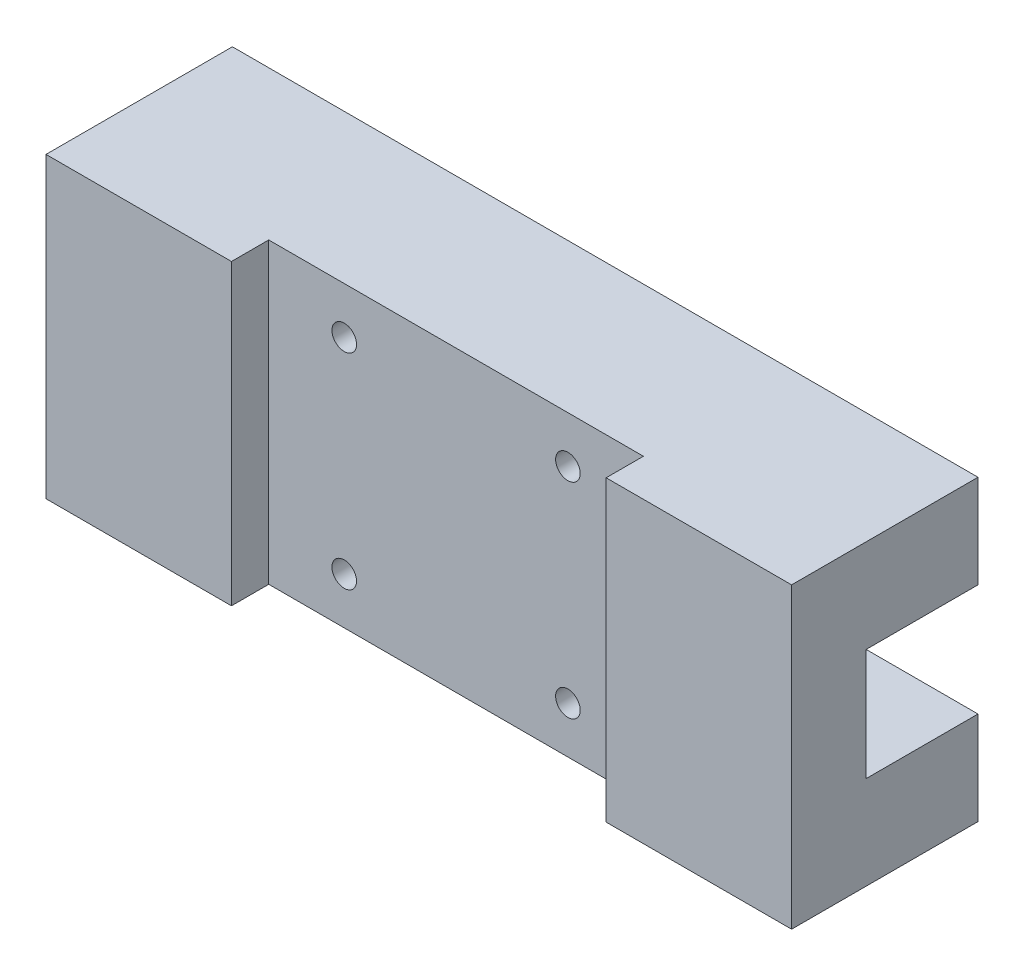
ISO-10303-21;
HEADER;
FILE_DESCRIPTION(('STEP AP214'),'2;1');
FILE_NAME('part.step','',(''),(''),'','','');
FILE_SCHEMA(('AUTOMOTIVE_DESIGN { 1 0 10303 214 1 1 1 1 }'));
ENDSEC;
DATA;
#1=APPLICATION_CONTEXT('core data for automotive mechanical design processes');
#2=APPLICATION_PROTOCOL_DEFINITION('international standard','automotive_design',2000,#1);
#3=PRODUCT_CONTEXT('',#1,'mechanical');
#4=PRODUCT('Part','Part','',(#3));
#5=PRODUCT_RELATED_PRODUCT_CATEGORY('part','',(#4));
#6=PRODUCT_DEFINITION_FORMATION('','',#4);
#7=PRODUCT_DEFINITION_CONTEXT('part definition',#1,'design');
#8=PRODUCT_DEFINITION('design','',#6,#7);
#9=PRODUCT_DEFINITION_SHAPE('','',#8);
#10=(LENGTH_UNIT() NAMED_UNIT(*) SI_UNIT(.MILLI.,.METRE.));
#11=(NAMED_UNIT(*) PLANE_ANGLE_UNIT() SI_UNIT($,.RADIAN.));
#12=(NAMED_UNIT(*) SI_UNIT($,.STERADIAN.) SOLID_ANGLE_UNIT());
#13=UNCERTAINTY_MEASURE_WITH_UNIT(LENGTH_MEASURE(1.E-05),#10,'distance_accuracy_value','');
#14=(GEOMETRIC_REPRESENTATION_CONTEXT(3) GLOBAL_UNCERTAINTY_ASSIGNED_CONTEXT((#13)) GLOBAL_UNIT_ASSIGNED_CONTEXT((#10,
#11,#12)) REPRESENTATION_CONTEXT('',''));
#15=CARTESIAN_POINT('',(0.,0.,0.));
#16=DIRECTION('',(0.,0.,1.));
#17=DIRECTION('',(1.,0.,0.));
#18=AXIS2_PLACEMENT_3D('',#15,#16,#17);
#19=CARTESIAN_POINT('',(0.,0.,50.));
#20=DIRECTION('',(0.,1.,0.));
#21=DIRECTION('',(0.,0.,1.));
#22=AXIS2_PLACEMENT_3D('',#19,#20,#21);
#23=PLANE('',#22);
#24=CARTESIAN_POINT('',(175.,0.,15.));
#25=DIRECTION('',(0.,-1.,0.));
#26=DIRECTION('',(0.,0.,-1.));
#27=AXIS2_PLACEMENT_3D('',#24,#25,#26);
#28=CIRCLE('',#27,5.);
#29=CARTESIAN_POINT('',(175.,0.,10.));
#30=VERTEX_POINT('',#29);
#31=EDGE_CURVE('E648',#30,#30,#28,.T.);
#32=ORIENTED_EDGE('',*,*,#31,.F.);
#33=EDGE_LOOP('',(#32));
#34=FACE_BOUND('',#33,.T.);
#35=DIRECTION('',(-1.,0.,0.));
#36=VECTOR('',#35,1.);
#37=CARTESIAN_POINT('',(49.75,0.,40.));
#38=LINE('',#37,#36);
#39=CARTESIAN_POINT('',(150.25,0.,40.));
#40=VERTEX_POINT('',#39);
#41=CARTESIAN_POINT('',(49.75,0.,40.));
#42=VERTEX_POINT('',#41);
#43=EDGE_CURVE('E167',#40,#42,#38,.T.);
#44=ORIENTED_EDGE('',*,*,#43,.T.);
#45=DIRECTION('',(0.,0.,1.));
#46=VECTOR('',#45,1.);
#47=CARTESIAN_POINT('',(49.75,0.,50.));
#48=LINE('',#47,#46);
#49=CARTESIAN_POINT('',(49.75,0.,50.));
#50=VERTEX_POINT('',#49);
#51=EDGE_CURVE('E162',#42,#50,#48,.T.);
#52=ORIENTED_EDGE('',*,*,#51,.T.);
#53=DIRECTION('',(1.,0.,0.));
#54=VECTOR('',#53,1.);
#55=CARTESIAN_POINT('',(0.,0.,50.));
#56=LINE('',#55,#54);
#57=CARTESIAN_POINT('',(0.,0.,50.));
#58=VERTEX_POINT('',#57);
#59=EDGE_CURVE('E191',#58,#50,#56,.T.);
#60=ORIENTED_EDGE('',*,*,#59,.F.);
#61=DIRECTION('',(0.,0.,-1.));
#62=VECTOR('',#61,1.);
#63=CARTESIAN_POINT('',(0.,0.,50.));
#64=LINE('',#63,#62);
#65=CARTESIAN_POINT('',(0.,0.,0.));
#66=VERTEX_POINT('',#65);
#67=EDGE_CURVE('E11',#58,#66,#64,.T.);
#68=ORIENTED_EDGE('',*,*,#67,.T.);
#69=DIRECTION('',(1.,0.,0.));
#70=VECTOR('',#69,1.);
#71=CARTESIAN_POINT('',(0.,0.,0.));
#72=LINE('',#71,#70);
#73=CARTESIAN_POINT('',(200.,0.,0.));
#74=VERTEX_POINT('',#73);
#75=EDGE_CURVE('E202',#66,#74,#72,.T.);
#76=ORIENTED_EDGE('',*,*,#75,.T.);
#77=DIRECTION('',(0.,0.,-1.));
#78=VECTOR('',#77,1.);
#79=CARTESIAN_POINT('',(200.,0.,50.));
#80=LINE('',#79,#78);
#81=CARTESIAN_POINT('',(200.,0.,50.));
#82=VERTEX_POINT('',#81);
#83=EDGE_CURVE('E42',#82,#74,#80,.T.);
#84=ORIENTED_EDGE('',*,*,#83,.F.);
#85=CARTESIAN_POINT('',(150.25,0.,50.));
#86=VERTEX_POINT('',#85);
#87=EDGE_CURVE('E189',#86,#82,#56,.T.);
#88=ORIENTED_EDGE('',*,*,#87,.F.);
#89=DIRECTION('',(0.,0.,-1.));
#90=VECTOR('',#89,1.);
#91=CARTESIAN_POINT('',(150.25,0.,50.));
#92=LINE('',#91,#90);
#93=EDGE_CURVE('E57',#86,#40,#92,.T.);
#94=ORIENTED_EDGE('',*,*,#93,.T.);
#95=EDGE_LOOP('',(#44,#52,#60,#68,#76,#84,#88,#94));
#96=FACE_BOUND('',#95,.T.);
#97=CARTESIAN_POINT('',(25.,0.,15.0000000000001));
#98=DIRECTION('',(0.,-1.,0.));
#99=DIRECTION('',(0.,0.,-1.));
#100=AXIS2_PLACEMENT_3D('',#97,#98,#99);
#101=CIRCLE('',#100,5.);
#102=CARTESIAN_POINT('',(25.,0.,10.0000000000001));
#103=VERTEX_POINT('',#102);
#104=EDGE_CURVE('E652',#103,#103,#101,.T.);
#105=ORIENTED_EDGE('',*,*,#104,.F.);
#106=EDGE_LOOP('',(#105));
#107=FACE_BOUND('',#106,.T.);
#108=ADVANCED_FACE('F34',(#34,#96,#107),#23,.F.);
#109=CARTESIAN_POINT('',(0.,0.,0.));
#110=DIRECTION('',(0.,0.,-1.));
#111=DIRECTION('',(-1.,0.,0.));
#112=AXIS2_PLACEMENT_3D('',#109,#110,#111);
#113=PLANE('',#112);
#114=CARTESIAN_POINT('',(70.,12.5,0.));
#115=DIRECTION('',(0.,0.,-1.));
#116=DIRECTION('',(-1.,0.,0.));
#117=AXIS2_PLACEMENT_3D('',#114,#115,#116);
#118=CIRCLE('',#117,6.525);
#119=CARTESIAN_POINT('',(63.475,12.5,0.));
#120=VERTEX_POINT('',#119);
#121=EDGE_CURVE('E618',#120,#120,#118,.T.);
#122=ORIENTED_EDGE('',*,*,#121,.F.);
#123=EDGE_LOOP('',(#122));
#124=FACE_BOUND('',#123,.T.);
#125=CARTESIAN_POINT('',(130.,12.5,0.));
#126=DIRECTION('',(0.,0.,-1.));
#127=DIRECTION('',(-1.,0.,0.));
#128=AXIS2_PLACEMENT_3D('',#125,#126,#127);
#129=CIRCLE('',#128,6.525);
#130=CARTESIAN_POINT('',(123.475,12.5,0.));
#131=VERTEX_POINT('',#130);
#132=EDGE_CURVE('E633',#131,#131,#129,.T.);
#133=ORIENTED_EDGE('',*,*,#132,.F.);
#134=EDGE_LOOP('',(#133));
#135=FACE_BOUND('',#134,.T.);
#136=DIRECTION('',(1.,0.,0.));
#137=VECTOR('',#136,1.);
#138=CARTESIAN_POINT('',(0.,25.,0.));
#139=LINE('',#138,#137);
#140=CARTESIAN_POINT('',(0.,25.,0.));
#141=VERTEX_POINT('',#140);
#142=CARTESIAN_POINT('',(200.,25.,0.));
#143=VERTEX_POINT('',#142);
#144=EDGE_CURVE('E156',#141,#143,#139,.T.);
#145=ORIENTED_EDGE('',*,*,#144,.T.);
#146=DIRECTION('',(0.,1.,0.));
#147=VECTOR('',#146,1.);
#148=CARTESIAN_POINT('',(200.,0.,0.));
#149=LINE('',#148,#147);
#150=EDGE_CURVE('E205',#74,#143,#149,.T.);
#151=ORIENTED_EDGE('',*,*,#150,.F.);
#152=ORIENTED_EDGE('',*,*,#75,.F.);
#153=DIRECTION('',(0.,-1.,0.));
#154=VECTOR('',#153,1.);
#155=CARTESIAN_POINT('',(0.,0.,0.));
#156=LINE('',#155,#154);
#157=EDGE_CURVE('E179',#141,#66,#156,.T.);
#158=ORIENTED_EDGE('',*,*,#157,.F.);
#159=EDGE_LOOP('',(#145,#151,#152,#158));
#160=FACE_BOUND('',#159,.T.);
#161=ADVANCED_FACE('F224',(#124,#135,#160),#113,.T.);
#162=CARTESIAN_POINT('',(0.,0.,50.));
#163=DIRECTION('',(0.,0.,-1.));
#164=DIRECTION('',(-1.,0.,0.));
#165=AXIS2_PLACEMENT_3D('',#162,#163,#164);
#166=PLANE('',#165);
#167=ORIENTED_EDGE('',*,*,#59,.T.);
#168=DIRECTION('',(0.,1.,0.));
#169=VECTOR('',#168,1.);
#170=CARTESIAN_POINT('',(49.75,0.,50.));
#171=LINE('',#170,#169);
#172=CARTESIAN_POINT('',(49.75,80.,50.));
#173=VERTEX_POINT('',#172);
#174=EDGE_CURVE('E170',#50,#173,#171,.T.);
#175=ORIENTED_EDGE('',*,*,#174,.T.);
#176=DIRECTION('',(-1.,0.,0.));
#177=VECTOR('',#176,1.);
#178=CARTESIAN_POINT('',(0.,80.,50.));
#179=LINE('',#178,#177);
#180=CARTESIAN_POINT('',(0.,80.,50.));
#181=VERTEX_POINT('',#180);
#182=EDGE_CURVE('E196',#173,#181,#179,.T.);
#183=ORIENTED_EDGE('',*,*,#182,.T.);
#184=DIRECTION('',(0.,-1.,0.));
#185=VECTOR('',#184,1.);
#186=CARTESIAN_POINT('',(0.,0.,50.));
#187=LINE('',#186,#185);
#188=EDGE_CURVE('E186',#181,#58,#187,.T.);
#189=ORIENTED_EDGE('',*,*,#188,.T.);
#190=EDGE_LOOP('',(#167,#175,#183,#189));
#191=FACE_BOUND('',#190,.T.);
#192=ADVANCED_FACE('F233',(#191),#166,.F.);
#193=CARTESIAN_POINT('',(0.,0.,50.));
#194=DIRECTION('',(1.,0.,0.));
#195=DIRECTION('',(0.,0.,-1.));
#196=AXIS2_PLACEMENT_3D('',#193,#194,#195);
#197=PLANE('',#196);
#198=DIRECTION('',(0.,-1.,0.));
#199=VECTOR('',#198,1.);
#200=CARTESIAN_POINT('',(0.,55.,30.));
#201=LINE('',#200,#199);
#202=CARTESIAN_POINT('',(0.,55.,30.));
#203=VERTEX_POINT('',#202);
#204=CARTESIAN_POINT('',(0.,25.,30.));
#205=VERTEX_POINT('',#204);
#206=EDGE_CURVE('E133',#203,#205,#201,.T.);
#207=ORIENTED_EDGE('',*,*,#206,.T.);
#208=DIRECTION('',(0.,0.,-1.));
#209=VECTOR('',#208,1.);
#210=CARTESIAN_POINT('',(0.,25.,30.));
#211=LINE('',#210,#209);
#212=EDGE_CURVE('E138',#205,#141,#211,.T.);
#213=ORIENTED_EDGE('',*,*,#212,.T.);
#214=ORIENTED_EDGE('',*,*,#157,.T.);
#215=ORIENTED_EDGE('',*,*,#67,.F.);
#216=ORIENTED_EDGE('',*,*,#188,.F.);
#217=DIRECTION('',(0.,0.,-1.));
#218=VECTOR('',#217,1.);
#219=CARTESIAN_POINT('',(0.,80.,50.));
#220=LINE('',#219,#218);
#221=CARTESIAN_POINT('',(0.,80.,0.));
#222=VERTEX_POINT('',#221);
#223=EDGE_CURVE('E200',#181,#222,#220,.T.);
#224=ORIENTED_EDGE('',*,*,#223,.T.);
#225=CARTESIAN_POINT('',(0.,55.,0.));
#226=VERTEX_POINT('',#225);
#227=EDGE_CURVE('E143',#222,#226,#156,.T.);
#228=ORIENTED_EDGE('',*,*,#227,.T.);
#229=DIRECTION('',(0.,0.,1.));
#230=VECTOR('',#229,1.);
#231=CARTESIAN_POINT('',(0.,55.,30.));
#232=LINE('',#231,#230);
#233=EDGE_CURVE('E49',#226,#203,#232,.T.);
#234=ORIENTED_EDGE('',*,*,#233,.T.);
#235=EDGE_LOOP('',(#207,#213,#214,#215,#216,#224,#228,#234));
#236=FACE_BOUND('',#235,.T.);
#237=ADVANCED_FACE('F36',(#236),#197,.F.);
#238=CARTESIAN_POINT('',(200.,0.,50.));
#239=DIRECTION('',(-1.,0.,0.));
#240=DIRECTION('',(0.,0.,1.));
#241=AXIS2_PLACEMENT_3D('',#238,#239,#240);
#242=PLANE('',#241);
#243=ORIENTED_EDGE('',*,*,#150,.T.);
#244=DIRECTION('',(0.,0.,-1.));
#245=VECTOR('',#244,1.);
#246=CARTESIAN_POINT('',(200.,25.,30.));
#247=LINE('',#246,#245);
#248=CARTESIAN_POINT('',(200.,25.,30.));
#249=VERTEX_POINT('',#248);
#250=EDGE_CURVE('E144',#249,#143,#247,.T.);
#251=ORIENTED_EDGE('',*,*,#250,.F.);
#252=DIRECTION('',(0.,-1.,0.));
#253=VECTOR('',#252,1.);
#254=CARTESIAN_POINT('',(200.,55.,30.));
#255=LINE('',#254,#253);
#256=CARTESIAN_POINT('',(200.,55.,30.));
#257=VERTEX_POINT('',#256);
#258=EDGE_CURVE('E146',#257,#249,#255,.T.);
#259=ORIENTED_EDGE('',*,*,#258,.F.);
#260=DIRECTION('',(0.,0.,1.));
#261=VECTOR('',#260,1.);
#262=CARTESIAN_POINT('',(200.,55.,30.));
#263=LINE('',#262,#261);
#264=CARTESIAN_POINT('',(200.,55.,0.));
#265=VERTEX_POINT('',#264);
#266=EDGE_CURVE('E125',#265,#257,#263,.T.);
#267=ORIENTED_EDGE('',*,*,#266,.F.);
#268=CARTESIAN_POINT('',(200.,80.,0.));
#269=VERTEX_POINT('',#268);
#270=EDGE_CURVE('E204',#265,#269,#149,.T.);
#271=ORIENTED_EDGE('',*,*,#270,.T.);
#272=DIRECTION('',(0.,0.,-1.));
#273=VECTOR('',#272,1.);
#274=CARTESIAN_POINT('',(200.,80.,50.));
#275=LINE('',#274,#273);
#276=CARTESIAN_POINT('',(200.,80.,50.));
#277=VERTEX_POINT('',#276);
#278=EDGE_CURVE('E210',#277,#269,#275,.T.);
#279=ORIENTED_EDGE('',*,*,#278,.F.);
#280=DIRECTION('',(0.,1.,0.));
#281=VECTOR('',#280,1.);
#282=CARTESIAN_POINT('',(200.,0.,50.));
#283=LINE('',#282,#281);
#284=EDGE_CURVE('E194',#82,#277,#283,.T.);
#285=ORIENTED_EDGE('',*,*,#284,.F.);
#286=ORIENTED_EDGE('',*,*,#83,.T.);
#287=EDGE_LOOP('',(#243,#251,#259,#267,#271,#279,#285,#286));
#288=FACE_BOUND('',#287,.T.);
#289=ADVANCED_FACE('F217',(#288),#242,.F.);
#290=CARTESIAN_POINT('',(0.,80.,50.));
#291=DIRECTION('',(0.,-1.,0.));
#292=DIRECTION('',(0.,0.,-1.));
#293=AXIS2_PLACEMENT_3D('',#290,#291,#292);
#294=PLANE('',#293);
#295=ORIENTED_EDGE('',*,*,#182,.F.);
#296=DIRECTION('',(0.,0.,1.));
#297=VECTOR('',#296,1.);
#298=CARTESIAN_POINT('',(49.75,80.,50.));
#299=LINE('',#298,#297);
#300=CARTESIAN_POINT('',(49.75,80.,40.));
#301=VERTEX_POINT('',#300);
#302=EDGE_CURVE('E159',#301,#173,#299,.T.);
#303=ORIENTED_EDGE('',*,*,#302,.F.);
#304=DIRECTION('',(-1.,0.,0.));
#305=VECTOR('',#304,1.);
#306=CARTESIAN_POINT('',(49.75,80.,40.));
#307=LINE('',#306,#305);
#308=CARTESIAN_POINT('',(150.25,80.,40.));
#309=VERTEX_POINT('',#308);
#310=EDGE_CURVE('E165',#309,#301,#307,.T.);
#311=ORIENTED_EDGE('',*,*,#310,.F.);
#312=DIRECTION('',(0.,0.,-1.));
#313=VECTOR('',#312,1.);
#314=CARTESIAN_POINT('',(150.25,80.,50.));
#315=LINE('',#314,#313);
#316=CARTESIAN_POINT('',(150.25,80.,50.));
#317=VERTEX_POINT('',#316);
#318=EDGE_CURVE('E172',#317,#309,#315,.T.);
#319=ORIENTED_EDGE('',*,*,#318,.F.);
#320=EDGE_CURVE('E197',#277,#317,#179,.T.);
#321=ORIENTED_EDGE('',*,*,#320,.F.);
#322=ORIENTED_EDGE('',*,*,#278,.T.);
#323=DIRECTION('',(-1.,0.,0.));
#324=VECTOR('',#323,1.);
#325=CARTESIAN_POINT('',(0.,80.,0.));
#326=LINE('',#325,#324);
#327=EDGE_CURVE('E190',#269,#222,#326,.T.);
#328=ORIENTED_EDGE('',*,*,#327,.T.);
#329=ORIENTED_EDGE('',*,*,#223,.F.);
#330=EDGE_LOOP('',(#295,#303,#311,#319,#321,#322,#328,#329));
#331=FACE_BOUND('',#330,.T.);
#332=ADVANCED_FACE('F238',(#331),#294,.F.);
#333=ORIENTED_EDGE('',*,*,#320,.T.);
#334=DIRECTION('',(0.,1.,0.));
#335=VECTOR('',#334,1.);
#336=CARTESIAN_POINT('',(150.25,0.,50.));
#337=LINE('',#336,#335);
#338=EDGE_CURVE('E182',#86,#317,#337,.T.);
#339=ORIENTED_EDGE('',*,*,#338,.F.);
#340=ORIENTED_EDGE('',*,*,#87,.T.);
#341=ORIENTED_EDGE('',*,*,#284,.T.);
#342=EDGE_LOOP('',(#333,#339,#340,#341));
#343=FACE_BOUND('',#342,.T.);
#344=ADVANCED_FACE('F247',(#343),#166,.F.);
#345=CARTESIAN_POINT('',(130.,67.5,0.));
#346=DIRECTION('',(0.,0.,-1.));
#347=DIRECTION('',(-1.,0.,0.));
#348=AXIS2_PLACEMENT_3D('',#345,#346,#347);
#349=CIRCLE('',#348,6.525);
#350=CARTESIAN_POINT('',(123.475,67.5,0.));
#351=VERTEX_POINT('',#350);
#352=EDGE_CURVE('E590',#351,#351,#349,.T.);
#353=ORIENTED_EDGE('',*,*,#352,.F.);
#354=EDGE_LOOP('',(#353));
#355=FACE_BOUND('',#354,.T.);
#356=CARTESIAN_POINT('',(70.,67.5,0.));
#357=DIRECTION('',(0.,0.,-1.));
#358=DIRECTION('',(-1.,0.,0.));
#359=AXIS2_PLACEMENT_3D('',#356,#357,#358);
#360=CIRCLE('',#359,6.525);
#361=CARTESIAN_POINT('',(63.475,67.5,0.));
#362=VERTEX_POINT('',#361);
#363=EDGE_CURVE('E603',#362,#362,#360,.T.);
#364=ORIENTED_EDGE('',*,*,#363,.F.);
#365=EDGE_LOOP('',(#364));
#366=FACE_BOUND('',#365,.T.);
#367=DIRECTION('',(1.,0.,0.));
#368=VECTOR('',#367,1.);
#369=CARTESIAN_POINT('',(0.,55.,0.));
#370=LINE('',#369,#368);
#371=EDGE_CURVE('E130',#226,#265,#370,.T.);
#372=ORIENTED_EDGE('',*,*,#371,.F.);
#373=ORIENTED_EDGE('',*,*,#227,.F.);
#374=ORIENTED_EDGE('',*,*,#327,.F.);
#375=ORIENTED_EDGE('',*,*,#270,.F.);
#376=EDGE_LOOP('',(#372,#373,#374,#375));
#377=FACE_BOUND('',#376,.T.);
#378=ADVANCED_FACE('F241',(#355,#366,#377),#113,.T.);
#379=CARTESIAN_POINT('',(49.75,0.,50.));
#380=DIRECTION('',(-1.,0.,0.));
#381=DIRECTION('',(0.,0.,1.));
#382=AXIS2_PLACEMENT_3D('',#379,#380,#381);
#383=PLANE('',#382);
#384=ORIENTED_EDGE('',*,*,#302,.T.);
#385=ORIENTED_EDGE('',*,*,#174,.F.);
#386=ORIENTED_EDGE('',*,*,#51,.F.);
#387=DIRECTION('',(0.,1.,0.));
#388=VECTOR('',#387,1.);
#389=CARTESIAN_POINT('',(49.75,0.,40.));
#390=LINE('',#389,#388);
#391=EDGE_CURVE('E177',#42,#301,#390,.T.);
#392=ORIENTED_EDGE('',*,*,#391,.T.);
#393=EDGE_LOOP('',(#384,#385,#386,#392));
#394=FACE_BOUND('',#393,.T.);
#395=ADVANCED_FACE('F252',(#394),#383,.F.);
#396=CARTESIAN_POINT('',(49.75,0.,40.));
#397=DIRECTION('',(0.,0.,-1.));
#398=DIRECTION('',(-1.,0.,0.));
#399=AXIS2_PLACEMENT_3D('',#396,#397,#398);
#400=PLANE('',#399);
#401=CARTESIAN_POINT('',(130.,67.5,40.));
#402=DIRECTION('',(0.,0.,-1.));
#403=DIRECTION('',(-1.,0.,0.));
#404=AXIS2_PLACEMENT_3D('',#401,#402,#403);
#405=CIRCLE('',#404,3.30000000000001);
#406=CARTESIAN_POINT('',(126.7,67.5,40.));
#407=VERTEX_POINT('',#406);
#408=EDGE_CURVE('E600',#407,#407,#405,.T.);
#409=ORIENTED_EDGE('',*,*,#408,.T.);
#410=EDGE_LOOP('',(#409));
#411=FACE_BOUND('',#410,.T.);
#412=CARTESIAN_POINT('',(70.,67.5,40.));
#413=DIRECTION('',(0.,0.,-1.));
#414=DIRECTION('',(-1.,0.,0.));
#415=AXIS2_PLACEMENT_3D('',#412,#413,#414);
#416=CIRCLE('',#415,3.30000000000001);
#417=CARTESIAN_POINT('',(66.7,67.5,40.));
#418=VERTEX_POINT('',#417);
#419=EDGE_CURVE('E615',#418,#418,#416,.T.);
#420=ORIENTED_EDGE('',*,*,#419,.T.);
#421=EDGE_LOOP('',(#420));
#422=FACE_BOUND('',#421,.T.);
#423=CARTESIAN_POINT('',(70.,12.5,40.));
#424=DIRECTION('',(0.,0.,-1.));
#425=DIRECTION('',(-1.,0.,0.));
#426=AXIS2_PLACEMENT_3D('',#423,#424,#425);
#427=CIRCLE('',#426,3.30000000000001);
#428=CARTESIAN_POINT('',(66.7,12.5,40.));
#429=VERTEX_POINT('',#428);
#430=EDGE_CURVE('E630',#429,#429,#427,.T.);
#431=ORIENTED_EDGE('',*,*,#430,.T.);
#432=EDGE_LOOP('',(#431));
#433=FACE_BOUND('',#432,.T.);
#434=CARTESIAN_POINT('',(130.,12.5,40.));
#435=DIRECTION('',(0.,0.,-1.));
#436=DIRECTION('',(-1.,0.,0.));
#437=AXIS2_PLACEMENT_3D('',#434,#435,#436);
#438=CIRCLE('',#437,3.30000000000001);
#439=CARTESIAN_POINT('',(126.7,12.5,40.));
#440=VERTEX_POINT('',#439);
#441=EDGE_CURVE('E645',#440,#440,#438,.T.);
#442=ORIENTED_EDGE('',*,*,#441,.T.);
#443=EDGE_LOOP('',(#442));
#444=FACE_BOUND('',#443,.T.);
#445=ORIENTED_EDGE('',*,*,#310,.T.);
#446=ORIENTED_EDGE('',*,*,#391,.F.);
#447=ORIENTED_EDGE('',*,*,#43,.F.);
#448=DIRECTION('',(0.,1.,0.));
#449=VECTOR('',#448,1.);
#450=CARTESIAN_POINT('',(150.25,0.,40.));
#451=LINE('',#450,#449);
#452=EDGE_CURVE('E180',#40,#309,#451,.T.);
#453=ORIENTED_EDGE('',*,*,#452,.T.);
#454=EDGE_LOOP('',(#445,#446,#447,#453));
#455=FACE_BOUND('',#454,.T.);
#456=ADVANCED_FACE('F250',(#411,#422,#433,#444,#455),#400,.F.);
#457=CARTESIAN_POINT('',(150.25,0.,50.));
#458=DIRECTION('',(1.,0.,0.));
#459=DIRECTION('',(0.,0.,-1.));
#460=AXIS2_PLACEMENT_3D('',#457,#458,#459);
#461=PLANE('',#460);
#462=ORIENTED_EDGE('',*,*,#318,.T.);
#463=ORIENTED_EDGE('',*,*,#452,.F.);
#464=ORIENTED_EDGE('',*,*,#93,.F.);
#465=ORIENTED_EDGE('',*,*,#338,.T.);
#466=EDGE_LOOP('',(#462,#463,#464,#465));
#467=FACE_BOUND('',#466,.T.);
#468=ADVANCED_FACE('F259',(#467),#461,.F.);
#469=CARTESIAN_POINT('',(0.,25.,30.));
#470=DIRECTION('',(0.,-1.,0.));
#471=DIRECTION('',(0.,0.,-1.));
#472=AXIS2_PLACEMENT_3D('',#469,#470,#471);
#473=PLANE('',#472);
#474=CARTESIAN_POINT('',(175.,25.,15.));
#475=DIRECTION('',(0.,-1.,0.));
#476=DIRECTION('',(0.,0.,-1.));
#477=AXIS2_PLACEMENT_3D('',#474,#475,#476);
#478=CIRCLE('',#477,2.64999999999999);
#479=CARTESIAN_POINT('',(175.,25.,12.35));
#480=VERTEX_POINT('',#479);
#481=EDGE_CURVE('E649',#480,#480,#478,.F.);
#482=ORIENTED_EDGE('',*,*,#481,.F.);
#483=EDGE_LOOP('',(#482));
#484=FACE_BOUND('',#483,.T.);
#485=CARTESIAN_POINT('',(25.,25.,15.0000000000001));
#486=DIRECTION('',(0.,-1.,0.));
#487=DIRECTION('',(0.,0.,-1.));
#488=AXIS2_PLACEMENT_3D('',#485,#486,#487);
#489=CIRCLE('',#488,2.64999999999999);
#490=CARTESIAN_POINT('',(25.,25.,12.3500000000001));
#491=VERTEX_POINT('',#490);
#492=EDGE_CURVE('E154',#491,#491,#489,.F.);
#493=ORIENTED_EDGE('',*,*,#492,.F.);
#494=EDGE_LOOP('',(#493));
#495=FACE_BOUND('',#494,.T.);
#496=ORIENTED_EDGE('',*,*,#250,.T.);
#497=ORIENTED_EDGE('',*,*,#144,.F.);
#498=ORIENTED_EDGE('',*,*,#212,.F.);
#499=DIRECTION('',(1.,0.,0.));
#500=VECTOR('',#499,1.);
#501=CARTESIAN_POINT('',(0.,25.,30.));
#502=LINE('',#501,#500);
#503=EDGE_CURVE('E129',#205,#249,#502,.T.);
#504=ORIENTED_EDGE('',*,*,#503,.T.);
#505=EDGE_LOOP('',(#496,#497,#498,#504));
#506=FACE_BOUND('',#505,.T.);
#507=ADVANCED_FACE('F227',(#484,#495,#506),#473,.F.);
#508=CARTESIAN_POINT('',(0.,55.,30.));
#509=DIRECTION('',(0.,0.,1.));
#510=DIRECTION('',(0.,-1.,0.));
#511=AXIS2_PLACEMENT_3D('',#508,#509,#510);
#512=PLANE('',#511);
#513=ORIENTED_EDGE('',*,*,#258,.T.);
#514=ORIENTED_EDGE('',*,*,#503,.F.);
#515=ORIENTED_EDGE('',*,*,#206,.F.);
#516=DIRECTION('',(1.,0.,0.));
#517=VECTOR('',#516,1.);
#518=CARTESIAN_POINT('',(0.,55.,30.));
#519=LINE('',#518,#517);
#520=EDGE_CURVE('E121',#203,#257,#519,.T.);
#521=ORIENTED_EDGE('',*,*,#520,.T.);
#522=EDGE_LOOP('',(#513,#514,#515,#521));
#523=FACE_BOUND('',#522,.T.);
#524=ADVANCED_FACE('F134',(#523),#512,.F.);
#525=CARTESIAN_POINT('',(0.,55.,30.));
#526=DIRECTION('',(0.,1.,0.));
#527=DIRECTION('',(0.,0.,1.));
#528=AXIS2_PLACEMENT_3D('',#525,#526,#527);
#529=PLANE('',#528);
#530=ORIENTED_EDGE('',*,*,#266,.T.);
#531=ORIENTED_EDGE('',*,*,#520,.F.);
#532=ORIENTED_EDGE('',*,*,#233,.F.);
#533=ORIENTED_EDGE('',*,*,#371,.T.);
#534=EDGE_LOOP('',(#530,#531,#532,#533));
#535=FACE_BOUND('',#534,.T.);
#536=ADVANCED_FACE('F123',(#535),#529,.F.);
#537=CARTESIAN_POINT('',(25.,0.,15.0000000000001));
#538=DIRECTION('',(0.,-1.,0.));
#539=DIRECTION('',(0.,0.,-1.));
#540=AXIS2_PLACEMENT_3D('',#537,#538,#539);
#541=CYLINDRICAL_SURFACE('',#540,2.64999999999999);
#542=ORIENTED_EDGE('',*,*,#492,.T.);
#543=EDGE_LOOP('',(#542));
#544=FACE_BOUND('',#543,.T.);
#545=CARTESIAN_POINT('',(25.,3.9,15.0000000000001));
#546=DIRECTION('',(0.,-1.,0.));
#547=DIRECTION('',(0.,0.,-1.));
#548=AXIS2_PLACEMENT_3D('',#545,#546,#547);
#549=CIRCLE('',#548,2.65);
#550=CARTESIAN_POINT('',(25.,3.9,12.3500000000001));
#551=VERTEX_POINT('',#550);
#552=EDGE_CURVE('E149',#551,#551,#549,.T.);
#553=ORIENTED_EDGE('',*,*,#552,.T.);
#554=EDGE_LOOP('',(#553));
#555=FACE_BOUND('',#554,.T.);
#556=ADVANCED_FACE('F338',(#544,#555),#541,.F.);
#557=CARTESIAN_POINT('',(27.65,3.9,15.0000000000001));
#558=DIRECTION('',(0.,1.,0.));
#559=DIRECTION('',(0.,0.,1.));
#560=AXIS2_PLACEMENT_3D('',#557,#558,#559);
#561=PLANE('',#560);
#562=ORIENTED_EDGE('',*,*,#552,.F.);
#563=EDGE_LOOP('',(#562));
#564=FACE_BOUND('',#563,.T.);
#565=CARTESIAN_POINT('',(25.,3.9,15.0000000000001));
#566=DIRECTION('',(0.,-1.,0.));
#567=DIRECTION('',(0.,0.,-1.));
#568=AXIS2_PLACEMENT_3D('',#565,#566,#567);
#569=CIRCLE('',#568,5.);
#570=CARTESIAN_POINT('',(25.,3.9,10.0000000000001));
#571=VERTEX_POINT('',#570);
#572=EDGE_CURVE('E664',#571,#571,#569,.T.);
#573=ORIENTED_EDGE('',*,*,#572,.T.);
#574=EDGE_LOOP('',(#573));
#575=FACE_BOUND('',#574,.T.);
#576=ADVANCED_FACE('F344',(#564,#575),#561,.F.);
#577=CARTESIAN_POINT('',(25.,0.,15.0000000000001));
#578=DIRECTION('',(0.,-1.,0.));
#579=DIRECTION('',(0.,0.,-1.));
#580=AXIS2_PLACEMENT_3D('',#577,#578,#579);
#581=CYLINDRICAL_SURFACE('',#580,5.);
#582=ORIENTED_EDGE('',*,*,#572,.F.);
#583=EDGE_LOOP('',(#582));
#584=FACE_BOUND('',#583,.T.);
#585=ORIENTED_EDGE('',*,*,#104,.T.);
#586=EDGE_LOOP('',(#585));
#587=FACE_BOUND('',#586,.T.);
#588=ADVANCED_FACE('F352',(#584,#587),#581,.F.);
#589=CARTESIAN_POINT('',(175.,0.,15.));
#590=DIRECTION('',(0.,-1.,0.));
#591=DIRECTION('',(0.,0.,-1.));
#592=AXIS2_PLACEMENT_3D('',#589,#590,#591);
#593=CYLINDRICAL_SURFACE('',#592,2.64999999999999);
#594=ORIENTED_EDGE('',*,*,#481,.T.);
#595=EDGE_LOOP('',(#594));
#596=FACE_BOUND('',#595,.T.);
#597=CARTESIAN_POINT('',(175.,3.9,15.));
#598=DIRECTION('',(0.,-1.,0.));
#599=DIRECTION('',(0.,0.,-1.));
#600=AXIS2_PLACEMENT_3D('',#597,#598,#599);
#601=CIRCLE('',#600,2.64999999999999);
#602=CARTESIAN_POINT('',(175.,3.9,12.35));
#603=VERTEX_POINT('',#602);
#604=EDGE_CURVE('E653',#603,#603,#601,.T.);
#605=ORIENTED_EDGE('',*,*,#604,.T.);
#606=EDGE_LOOP('',(#605));
#607=FACE_BOUND('',#606,.T.);
#608=ADVANCED_FACE('F360',(#596,#607),#593,.F.);
#609=CARTESIAN_POINT('',(177.65,3.9,15.));
#610=DIRECTION('',(0.,1.,0.));
#611=DIRECTION('',(0.,0.,1.));
#612=AXIS2_PLACEMENT_3D('',#609,#610,#611);
#613=PLANE('',#612);
#614=ORIENTED_EDGE('',*,*,#604,.F.);
#615=EDGE_LOOP('',(#614));
#616=FACE_BOUND('',#615,.T.);
#617=CARTESIAN_POINT('',(175.,3.9,15.));
#618=DIRECTION('',(0.,-1.,0.));
#619=DIRECTION('',(0.,0.,-1.));
#620=AXIS2_PLACEMENT_3D('',#617,#618,#619);
#621=CIRCLE('',#620,5.);
#622=CARTESIAN_POINT('',(175.,3.9,10.));
#623=VERTEX_POINT('',#622);
#624=EDGE_CURVE('E656',#623,#623,#621,.T.);
#625=ORIENTED_EDGE('',*,*,#624,.T.);
#626=EDGE_LOOP('',(#625));
#627=FACE_BOUND('',#626,.T.);
#628=ADVANCED_FACE('F368',(#616,#627),#613,.F.);
#629=CARTESIAN_POINT('',(175.,0.,15.));
#630=DIRECTION('',(0.,-1.,0.));
#631=DIRECTION('',(0.,0.,-1.));
#632=AXIS2_PLACEMENT_3D('',#629,#630,#631);
#633=CYLINDRICAL_SURFACE('',#632,5.);
#634=ORIENTED_EDGE('',*,*,#624,.F.);
#635=EDGE_LOOP('',(#634));
#636=FACE_BOUND('',#635,.T.);
#637=ORIENTED_EDGE('',*,*,#31,.T.);
#638=EDGE_LOOP('',(#637));
#639=FACE_BOUND('',#638,.T.);
#640=ADVANCED_FACE('F376',(#636,#639),#633,.F.);
#641=CARTESIAN_POINT('',(130.,12.5,0.));
#642=DIRECTION('',(0.,0.,-1.));
#643=DIRECTION('',(-1.,0.,0.));
#644=AXIS2_PLACEMENT_3D('',#641,#642,#643);
#645=CYLINDRICAL_SURFACE('',#644,3.30000000000001);
#646=ORIENTED_EDGE('',*,*,#441,.F.);
#647=EDGE_LOOP('',(#646));
#648=FACE_BOUND('',#647,.T.);
#649=CARTESIAN_POINT('',(130.,12.5,4.6));
#650=DIRECTION('',(0.,0.,-1.));
#651=DIRECTION('',(-1.,0.,0.));
#652=AXIS2_PLACEMENT_3D('',#649,#650,#651);
#653=CIRCLE('',#652,3.30000000000003);
#654=CARTESIAN_POINT('',(126.7,12.5,4.6));
#655=VERTEX_POINT('',#654);
#656=EDGE_CURVE('E642',#655,#655,#653,.T.);
#657=ORIENTED_EDGE('',*,*,#656,.T.);
#658=EDGE_LOOP('',(#657));
#659=FACE_BOUND('',#658,.T.);
#660=ADVANCED_FACE('F384',(#648,#659),#645,.F.);
#661=CARTESIAN_POINT('',(136.5,12.5,4.6));
#662=DIRECTION('',(0.,0.,1.));
#663=DIRECTION('',(1.,0.,0.));
#664=AXIS2_PLACEMENT_3D('',#661,#662,#663);
#665=PLANE('',#664);
#666=ORIENTED_EDGE('',*,*,#656,.F.);
#667=EDGE_LOOP('',(#666));
#668=FACE_BOUND('',#667,.T.);
#669=CARTESIAN_POINT('',(130.,12.5,4.6));
#670=DIRECTION('',(0.,0.,-1.));
#671=DIRECTION('',(-1.,0.,0.));
#672=AXIS2_PLACEMENT_3D('',#669,#670,#671);
#673=CIRCLE('',#672,6.50000000000001);
#674=CARTESIAN_POINT('',(123.5,12.5,4.6));
#675=VERTEX_POINT('',#674);
#676=EDGE_CURVE('E639',#675,#675,#673,.T.);
#677=ORIENTED_EDGE('',*,*,#676,.T.);
#678=EDGE_LOOP('',(#677));
#679=FACE_BOUND('',#678,.T.);
#680=ADVANCED_FACE('F393',(#668,#679),#665,.F.);
#681=CARTESIAN_POINT('',(130.,12.5,0.));
#682=DIRECTION('',(0.,0.,-1.));
#683=DIRECTION('',(-1.,0.,0.));
#684=AXIS2_PLACEMENT_3D('',#681,#682,#683);
#685=CYLINDRICAL_SURFACE('',#684,6.50000000000001);
#686=ORIENTED_EDGE('',*,*,#676,.F.);
#687=EDGE_LOOP('',(#686));
#688=FACE_BOUND('',#687,.T.);
#689=CARTESIAN_POINT('',(130.,12.5,0.0250000000000004));
#690=DIRECTION('',(0.,0.,-1.));
#691=DIRECTION('',(-1.,0.,0.));
#692=AXIS2_PLACEMENT_3D('',#689,#690,#691);
#693=CIRCLE('',#692,6.50000000000001);
#694=CARTESIAN_POINT('',(123.5,12.5,0.0250000000000004));
#695=VERTEX_POINT('',#694);
#696=EDGE_CURVE('E636',#695,#695,#693,.T.);
#697=ORIENTED_EDGE('',*,*,#696,.T.);
#698=EDGE_LOOP('',(#697));
#699=FACE_BOUND('',#698,.T.);
#700=ADVANCED_FACE('F401',(#688,#699),#685,.F.);
#701=CARTESIAN_POINT('',(130.,12.5,0.));
#702=DIRECTION('',(0.,0.,-1.));
#703=DIRECTION('',(-1.,0.,0.));
#704=AXIS2_PLACEMENT_3D('',#701,#702,#703);
#705=CONICAL_SURFACE('',#704,6.525,0.785398163397333);
#706=ORIENTED_EDGE('',*,*,#696,.F.);
#707=EDGE_LOOP('',(#706));
#708=FACE_BOUND('',#707,.T.);
#709=ORIENTED_EDGE('',*,*,#132,.T.);
#710=EDGE_LOOP('',(#709));
#711=FACE_BOUND('',#710,.T.);
#712=ADVANCED_FACE('F409',(#708,#711),#705,.F.);
#713=CARTESIAN_POINT('',(70.,12.5,0.));
#714=DIRECTION('',(0.,0.,-1.));
#715=DIRECTION('',(-1.,0.,0.));
#716=AXIS2_PLACEMENT_3D('',#713,#714,#715);
#717=CYLINDRICAL_SURFACE('',#716,3.30000000000001);
#718=ORIENTED_EDGE('',*,*,#430,.F.);
#719=EDGE_LOOP('',(#718));
#720=FACE_BOUND('',#719,.T.);
#721=CARTESIAN_POINT('',(70.,12.5,4.6));
#722=DIRECTION('',(0.,0.,-1.));
#723=DIRECTION('',(-1.,0.,0.));
#724=AXIS2_PLACEMENT_3D('',#721,#722,#723);
#725=CIRCLE('',#724,3.30000000000003);
#726=CARTESIAN_POINT('',(66.7,12.5,4.6));
#727=VERTEX_POINT('',#726);
#728=EDGE_CURVE('E627',#727,#727,#725,.T.);
#729=ORIENTED_EDGE('',*,*,#728,.T.);
#730=EDGE_LOOP('',(#729));
#731=FACE_BOUND('',#730,.T.);
#732=ADVANCED_FACE('F417',(#720,#731),#717,.F.);
#733=CARTESIAN_POINT('',(76.5,12.5,4.6));
#734=DIRECTION('',(0.,0.,1.));
#735=DIRECTION('',(1.,0.,0.));
#736=AXIS2_PLACEMENT_3D('',#733,#734,#735);
#737=PLANE('',#736);
#738=ORIENTED_EDGE('',*,*,#728,.F.);
#739=EDGE_LOOP('',(#738));
#740=FACE_BOUND('',#739,.T.);
#741=CARTESIAN_POINT('',(70.,12.5,4.6));
#742=DIRECTION('',(0.,0.,-1.));
#743=DIRECTION('',(-1.,0.,0.));
#744=AXIS2_PLACEMENT_3D('',#741,#742,#743);
#745=CIRCLE('',#744,6.49999999999999);
#746=CARTESIAN_POINT('',(63.5,12.5,4.6));
#747=VERTEX_POINT('',#746);
#748=EDGE_CURVE('E624',#747,#747,#745,.T.);
#749=ORIENTED_EDGE('',*,*,#748,.T.);
#750=EDGE_LOOP('',(#749));
#751=FACE_BOUND('',#750,.T.);
#752=ADVANCED_FACE('F425',(#740,#751),#737,.F.);
#753=CARTESIAN_POINT('',(70.,12.5,0.));
#754=DIRECTION('',(0.,0.,-1.));
#755=DIRECTION('',(-1.,0.,0.));
#756=AXIS2_PLACEMENT_3D('',#753,#754,#755);
#757=CYLINDRICAL_SURFACE('',#756,6.5);
#758=ORIENTED_EDGE('',*,*,#748,.F.);
#759=EDGE_LOOP('',(#758));
#760=FACE_BOUND('',#759,.T.);
#761=CARTESIAN_POINT('',(70.,12.5,0.0250000000000004));
#762=DIRECTION('',(0.,0.,-1.));
#763=DIRECTION('',(-1.,0.,0.));
#764=AXIS2_PLACEMENT_3D('',#761,#762,#763);
#765=CIRCLE('',#764,6.50000000000001);
#766=CARTESIAN_POINT('',(63.5,12.5,0.0250000000000004));
#767=VERTEX_POINT('',#766);
#768=EDGE_CURVE('E621',#767,#767,#765,.T.);
#769=ORIENTED_EDGE('',*,*,#768,.T.);
#770=EDGE_LOOP('',(#769));
#771=FACE_BOUND('',#770,.T.);
#772=ADVANCED_FACE('F433',(#760,#771),#757,.F.);
#773=CARTESIAN_POINT('',(70.,12.5,0.));
#774=DIRECTION('',(0.,0.,-1.));
#775=DIRECTION('',(-1.,0.,0.));
#776=AXIS2_PLACEMENT_3D('',#773,#774,#775);
#777=CONICAL_SURFACE('',#776,6.525,0.785398163397333);
#778=ORIENTED_EDGE('',*,*,#768,.F.);
#779=EDGE_LOOP('',(#778));
#780=FACE_BOUND('',#779,.T.);
#781=ORIENTED_EDGE('',*,*,#121,.T.);
#782=EDGE_LOOP('',(#781));
#783=FACE_BOUND('',#782,.T.);
#784=ADVANCED_FACE('F441',(#780,#783),#777,.F.);
#785=CARTESIAN_POINT('',(70.,67.5,0.));
#786=DIRECTION('',(0.,0.,-1.));
#787=DIRECTION('',(-1.,0.,0.));
#788=AXIS2_PLACEMENT_3D('',#785,#786,#787);
#789=CYLINDRICAL_SURFACE('',#788,3.30000000000001);
#790=ORIENTED_EDGE('',*,*,#419,.F.);
#791=EDGE_LOOP('',(#790));
#792=FACE_BOUND('',#791,.T.);
#793=CARTESIAN_POINT('',(70.,67.5,4.6));
#794=DIRECTION('',(0.,0.,-1.));
#795=DIRECTION('',(-1.,0.,0.));
#796=AXIS2_PLACEMENT_3D('',#793,#794,#795);
#797=CIRCLE('',#796,3.30000000000003);
#798=CARTESIAN_POINT('',(66.7,67.5,4.6));
#799=VERTEX_POINT('',#798);
#800=EDGE_CURVE('E612',#799,#799,#797,.T.);
#801=ORIENTED_EDGE('',*,*,#800,.T.);
#802=EDGE_LOOP('',(#801));
#803=FACE_BOUND('',#802,.T.);
#804=ADVANCED_FACE('F449',(#792,#803),#789,.F.);
#805=CARTESIAN_POINT('',(76.5,67.5,4.6));
#806=DIRECTION('',(0.,0.,1.));
#807=DIRECTION('',(1.,0.,0.));
#808=AXIS2_PLACEMENT_3D('',#805,#806,#807);
#809=PLANE('',#808);
#810=ORIENTED_EDGE('',*,*,#800,.F.);
#811=EDGE_LOOP('',(#810));
#812=FACE_BOUND('',#811,.T.);
#813=CARTESIAN_POINT('',(70.,67.5,4.6));
#814=DIRECTION('',(0.,0.,-1.));
#815=DIRECTION('',(-1.,0.,0.));
#816=AXIS2_PLACEMENT_3D('',#813,#814,#815);
#817=CIRCLE('',#816,6.49999999999999);
#818=CARTESIAN_POINT('',(63.5,67.5,4.6));
#819=VERTEX_POINT('',#818);
#820=EDGE_CURVE('E609',#819,#819,#817,.T.);
#821=ORIENTED_EDGE('',*,*,#820,.T.);
#822=EDGE_LOOP('',(#821));
#823=FACE_BOUND('',#822,.T.);
#824=ADVANCED_FACE('F457',(#812,#823),#809,.F.);
#825=CARTESIAN_POINT('',(70.,67.5,0.));
#826=DIRECTION('',(0.,0.,-1.));
#827=DIRECTION('',(-1.,0.,0.));
#828=AXIS2_PLACEMENT_3D('',#825,#826,#827);
#829=CYLINDRICAL_SURFACE('',#828,6.5);
#830=ORIENTED_EDGE('',*,*,#820,.F.);
#831=EDGE_LOOP('',(#830));
#832=FACE_BOUND('',#831,.T.);
#833=CARTESIAN_POINT('',(70.,67.5,0.0250000000000004));
#834=DIRECTION('',(0.,0.,-1.));
#835=DIRECTION('',(-1.,0.,0.));
#836=AXIS2_PLACEMENT_3D('',#833,#834,#835);
#837=CIRCLE('',#836,6.50000000000001);
#838=CARTESIAN_POINT('',(63.5,67.5,0.0250000000000004));
#839=VERTEX_POINT('',#838);
#840=EDGE_CURVE('E606',#839,#839,#837,.T.);
#841=ORIENTED_EDGE('',*,*,#840,.T.);
#842=EDGE_LOOP('',(#841));
#843=FACE_BOUND('',#842,.T.);
#844=ADVANCED_FACE('F465',(#832,#843),#829,.F.);
#845=CARTESIAN_POINT('',(70.,67.5,0.));
#846=DIRECTION('',(0.,0.,-1.));
#847=DIRECTION('',(-1.,0.,0.));
#848=AXIS2_PLACEMENT_3D('',#845,#846,#847);
#849=CONICAL_SURFACE('',#848,6.525,0.785398163397333);
#850=ORIENTED_EDGE('',*,*,#840,.F.);
#851=EDGE_LOOP('',(#850));
#852=FACE_BOUND('',#851,.T.);
#853=ORIENTED_EDGE('',*,*,#363,.T.);
#854=EDGE_LOOP('',(#853));
#855=FACE_BOUND('',#854,.T.);
#856=ADVANCED_FACE('F473',(#852,#855),#849,.F.);
#857=CARTESIAN_POINT('',(130.,67.5,0.));
#858=DIRECTION('',(0.,0.,-1.));
#859=DIRECTION('',(-1.,0.,0.));
#860=AXIS2_PLACEMENT_3D('',#857,#858,#859);
#861=CYLINDRICAL_SURFACE('',#860,3.30000000000001);
#862=ORIENTED_EDGE('',*,*,#408,.F.);
#863=EDGE_LOOP('',(#862));
#864=FACE_BOUND('',#863,.T.);
#865=CARTESIAN_POINT('',(130.,67.5,4.6));
#866=DIRECTION('',(0.,0.,-1.));
#867=DIRECTION('',(-1.,0.,0.));
#868=AXIS2_PLACEMENT_3D('',#865,#866,#867);
#869=CIRCLE('',#868,3.30000000000003);
#870=CARTESIAN_POINT('',(126.7,67.5,4.6));
#871=VERTEX_POINT('',#870);
#872=EDGE_CURVE('E597',#871,#871,#869,.T.);
#873=ORIENTED_EDGE('',*,*,#872,.T.);
#874=EDGE_LOOP('',(#873));
#875=FACE_BOUND('',#874,.T.);
#876=ADVANCED_FACE('F481',(#864,#875),#861,.F.);
#877=CARTESIAN_POINT('',(136.5,67.5,4.6));
#878=DIRECTION('',(0.,0.,1.));
#879=DIRECTION('',(1.,0.,0.));
#880=AXIS2_PLACEMENT_3D('',#877,#878,#879);
#881=PLANE('',#880);
#882=ORIENTED_EDGE('',*,*,#872,.F.);
#883=EDGE_LOOP('',(#882));
#884=FACE_BOUND('',#883,.T.);
#885=CARTESIAN_POINT('',(130.,67.5,4.6));
#886=DIRECTION('',(0.,0.,-1.));
#887=DIRECTION('',(-1.,0.,0.));
#888=AXIS2_PLACEMENT_3D('',#885,#886,#887);
#889=CIRCLE('',#888,6.50000000000001);
#890=CARTESIAN_POINT('',(123.5,67.5,4.6));
#891=VERTEX_POINT('',#890);
#892=EDGE_CURVE('E592',#891,#891,#889,.T.);
#893=ORIENTED_EDGE('',*,*,#892,.T.);
#894=EDGE_LOOP('',(#893));
#895=FACE_BOUND('',#894,.T.);
#896=ADVANCED_FACE('F489',(#884,#895),#881,.F.);
#897=CARTESIAN_POINT('',(130.,67.5,0.));
#898=DIRECTION('',(0.,0.,-1.));
#899=DIRECTION('',(-1.,0.,0.));
#900=AXIS2_PLACEMENT_3D('',#897,#898,#899);
#901=CYLINDRICAL_SURFACE('',#900,6.50000000000001);
#902=ORIENTED_EDGE('',*,*,#892,.F.);
#903=EDGE_LOOP('',(#902));
#904=FACE_BOUND('',#903,.T.);
#905=CARTESIAN_POINT('',(130.,67.5,0.0250000000000004));
#906=DIRECTION('',(0.,0.,-1.));
#907=DIRECTION('',(-1.,0.,0.));
#908=AXIS2_PLACEMENT_3D('',#905,#906,#907);
#909=CIRCLE('',#908,6.50000000000001);
#910=CARTESIAN_POINT('',(123.5,67.5,0.0250000000000004));
#911=VERTEX_POINT('',#910);
#912=EDGE_CURVE('E587',#911,#911,#909,.T.);
#913=ORIENTED_EDGE('',*,*,#912,.T.);
#914=EDGE_LOOP('',(#913));
#915=FACE_BOUND('',#914,.T.);
#916=ADVANCED_FACE('F497',(#904,#915),#901,.F.);
#917=CARTESIAN_POINT('',(130.,67.5,0.));
#918=DIRECTION('',(0.,0.,-1.));
#919=DIRECTION('',(-1.,0.,0.));
#920=AXIS2_PLACEMENT_3D('',#917,#918,#919);
#921=CONICAL_SURFACE('',#920,6.525,0.785398163397333);
#922=ORIENTED_EDGE('',*,*,#912,.F.);
#923=EDGE_LOOP('',(#922));
#924=FACE_BOUND('',#923,.T.);
#925=ORIENTED_EDGE('',*,*,#352,.T.);
#926=EDGE_LOOP('',(#925));
#927=FACE_BOUND('',#926,.T.);
#928=ADVANCED_FACE('F505',(#924,#927),#921,.F.);
#929=CLOSED_SHELL('',(#108,#161,#192,#237,#289,#332,#344,#378,#395,#456,#468,#507,#524,#536,
#556,#576,#588,#608,#628,#640,#660,#680,#700,#712,#732,#752,#772,#784,#804,#824,#844,#856,#876,
#896,#916,#928));
#930=MANIFOLD_SOLID_BREP('B2',#929);
#931=ADVANCED_BREP_SHAPE_REPRESENTATION('',(#18,#930),#14);
#932=SHAPE_DEFINITION_REPRESENTATION(#9,#931);
ENDSEC;
END-ISO-10303-21;
